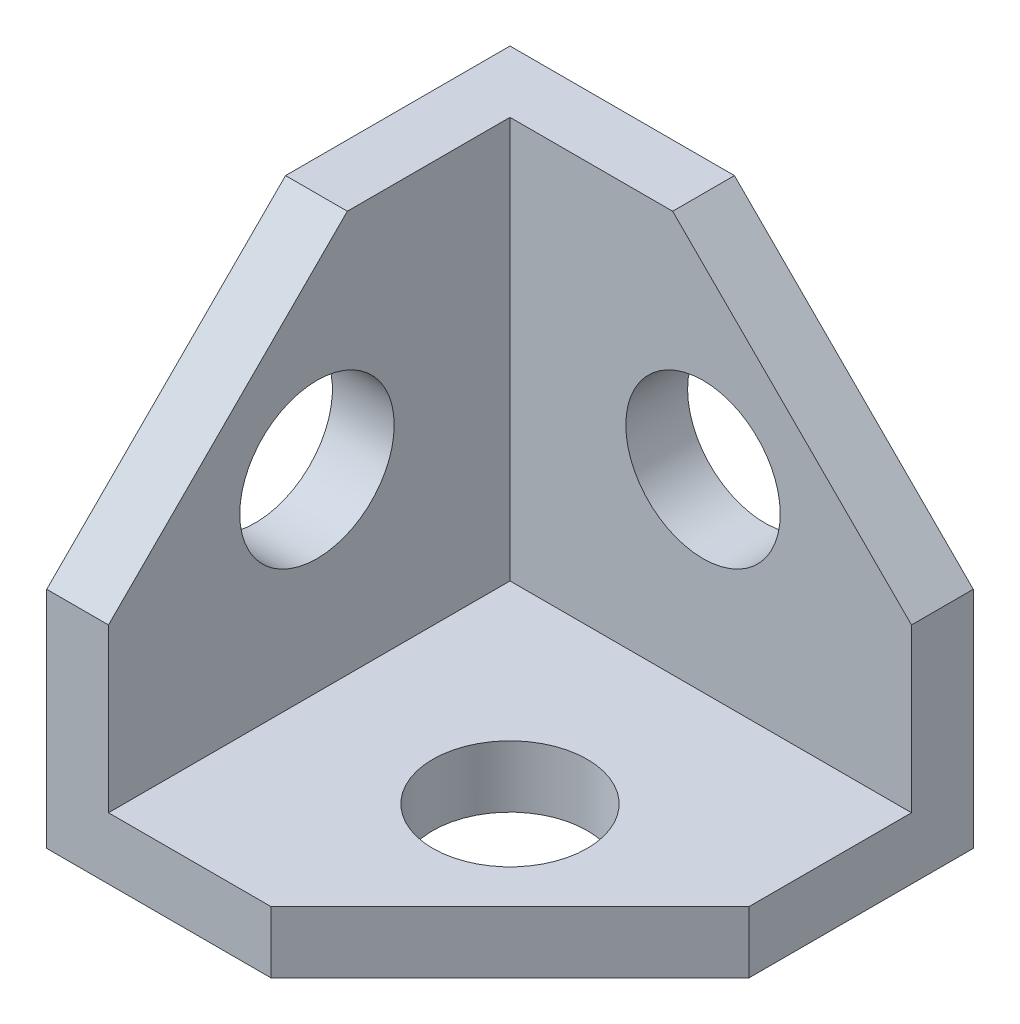
ISO-10303-21;
HEADER;
FILE_DESCRIPTION(('STEP AP214'),'2;1');
FILE_NAME('part.step','',(''),(''),'','','');
FILE_SCHEMA(('AUTOMOTIVE_DESIGN { 1 0 10303 214 1 1 1 1 }'));
ENDSEC;
DATA;
#1=APPLICATION_CONTEXT('core data for automotive mechanical design processes');
#2=APPLICATION_PROTOCOL_DEFINITION('international standard','automotive_design',2000,#1);
#3=PRODUCT_CONTEXT('',#1,'mechanical');
#4=PRODUCT('Part','Part','',(#3));
#5=PRODUCT_RELATED_PRODUCT_CATEGORY('part','',(#4));
#6=PRODUCT_DEFINITION_FORMATION('','',#4);
#7=PRODUCT_DEFINITION_CONTEXT('part definition',#1,'design');
#8=PRODUCT_DEFINITION('design','',#6,#7);
#9=PRODUCT_DEFINITION_SHAPE('','',#8);
#10=(LENGTH_UNIT() NAMED_UNIT(*) SI_UNIT(.MILLI.,.METRE.));
#11=(NAMED_UNIT(*) PLANE_ANGLE_UNIT() SI_UNIT($,.RADIAN.));
#12=(NAMED_UNIT(*) SI_UNIT($,.STERADIAN.) SOLID_ANGLE_UNIT());
#13=UNCERTAINTY_MEASURE_WITH_UNIT(LENGTH_MEASURE(1.E-05),#10,'distance_accuracy_value','');
#14=(GEOMETRIC_REPRESENTATION_CONTEXT(3) GLOBAL_UNCERTAINTY_ASSIGNED_CONTEXT((#13)) GLOBAL_UNIT_ASSIGNED_CONTEXT((#10,
#11,#12)) REPRESENTATION_CONTEXT('',''));
#15=CARTESIAN_POINT('',(0.,0.,0.));
#16=DIRECTION('',(0.,0.,1.));
#17=DIRECTION('',(1.,0.,0.));
#18=AXIS2_PLACEMENT_3D('',#15,#16,#17);
#19=CARTESIAN_POINT('',(10.2,2.4,10.2));
#20=DIRECTION('',(0.,1.,0.));
#21=DIRECTION('',(0.,0.,1.));
#22=AXIS2_PLACEMENT_3D('',#19,#20,#21);
#23=PLANE('',#22);
#24=CARTESIAN_POINT('',(9.9,2.4,9.9));
#25=DIRECTION('',(0.,1.,0.));
#26=DIRECTION('',(0.,0.,1.));
#27=AXIS2_PLACEMENT_3D('',#24,#25,#26);
#28=CIRCLE('',#27,2.99999999999999);
#29=CARTESIAN_POINT('',(9.9,2.4,12.9));
#30=VERTEX_POINT('',#29);
#31=EDGE_CURVE('E229',#30,#30,#28,.T.);
#32=ORIENTED_EDGE('',*,*,#31,.F.);
#33=EDGE_LOOP('',(#32));
#34=FACE_BOUND('',#33,.T.);
#35=DIRECTION('',(0.707106781186548,0.,-0.707106781186548));
#36=VECTOR('',#35,1.);
#37=CARTESIAN_POINT('',(13.36,2.4,13.36));
#38=LINE('',#37,#36);
#39=CARTESIAN_POINT('',(18.,2.4,8.72));
#40=VERTEX_POINT('',#39);
#41=CARTESIAN_POINT('',(8.72,2.4,18.));
#42=VERTEX_POINT('',#41);
#43=EDGE_CURVE('E294',#40,#42,#38,.F.);
#44=ORIENTED_EDGE('',*,*,#43,.F.);
#45=DIRECTION('',(0.,0.,1.));
#46=VECTOR('',#45,1.);
#47=CARTESIAN_POINT('',(18.,2.4,2.4));
#48=LINE('',#47,#46);
#49=CARTESIAN_POINT('',(18.,2.4,2.4));
#50=VERTEX_POINT('',#49);
#51=EDGE_CURVE('E57',#50,#40,#48,.T.);
#52=ORIENTED_EDGE('',*,*,#51,.F.);
#53=DIRECTION('',(1.,0.,0.));
#54=VECTOR('',#53,1.);
#55=CARTESIAN_POINT('',(18.,2.4,2.4));
#56=LINE('',#55,#54);
#57=CARTESIAN_POINT('',(2.4,2.4,2.4));
#58=VERTEX_POINT('',#57);
#59=EDGE_CURVE('E192',#58,#50,#56,.T.);
#60=ORIENTED_EDGE('',*,*,#59,.F.);
#61=DIRECTION('',(0.,0.,-1.));
#62=VECTOR('',#61,1.);
#63=CARTESIAN_POINT('',(2.4,2.4,8.72));
#64=LINE('',#63,#62);
#65=CARTESIAN_POINT('',(2.4,2.4,18.));
#66=VERTEX_POINT('',#65);
#67=EDGE_CURVE('E206',#66,#58,#64,.T.);
#68=ORIENTED_EDGE('',*,*,#67,.F.);
#69=DIRECTION('',(1.,0.,0.));
#70=VECTOR('',#69,1.);
#71=CARTESIAN_POINT('',(2.4,2.4,18.));
#72=LINE('',#71,#70);
#73=EDGE_CURVE('E209',#66,#42,#72,.T.);
#74=ORIENTED_EDGE('',*,*,#73,.T.);
#75=EDGE_LOOP('',(#44,#52,#60,#68,#74));
#76=FACE_BOUND('',#75,.T.);
#77=ADVANCED_FACE('F40',(#34,#76),#23,.T.);
#78=CARTESIAN_POINT('',(13.36,1.2,13.36));
#79=DIRECTION('',(0.707106781186548,0.,0.707106781186548));
#80=DIRECTION('',(0.707106781186548,0.,-0.707106781186548));
#81=AXIS2_PLACEMENT_3D('',#78,#79,#80);
#82=PLANE('',#81);
#83=DIRECTION('',(0.,1.,0.));
#84=VECTOR('',#83,1.);
#85=CARTESIAN_POINT('',(18.,9.,8.72));
#86=LINE('',#85,#84);
#87=CARTESIAN_POINT('',(18.,0.,8.72));
#88=VERTEX_POINT('',#87);
#89=EDGE_CURVE('E298',#88,#40,#86,.T.);
#90=ORIENTED_EDGE('',*,*,#89,.T.);
#91=ORIENTED_EDGE('',*,*,#43,.T.);
#92=DIRECTION('',(0.,1.,0.));
#93=VECTOR('',#92,1.);
#94=CARTESIAN_POINT('',(8.72,9.,18.));
#95=LINE('',#94,#93);
#96=CARTESIAN_POINT('',(8.72,0.,18.));
#97=VERTEX_POINT('',#96);
#98=EDGE_CURVE('E49',#97,#42,#95,.T.);
#99=ORIENTED_EDGE('',*,*,#98,.F.);
#100=DIRECTION('',(0.707106781186548,0.,-0.707106781186548));
#101=VECTOR('',#100,1.);
#102=CARTESIAN_POINT('',(8.72,0.,18.));
#103=LINE('',#102,#101);
#104=EDGE_CURVE('E12',#97,#88,#103,.T.);
#105=ORIENTED_EDGE('',*,*,#104,.T.);
#106=EDGE_LOOP('',(#90,#91,#99,#105));
#107=FACE_BOUND('',#106,.T.);
#108=ADVANCED_FACE('F243',(#107),#82,.T.);
#109=CARTESIAN_POINT('',(9.,0.,9.));
#110=DIRECTION('',(0.,1.,0.));
#111=DIRECTION('',(0.,0.,1.));
#112=AXIS2_PLACEMENT_3D('',#109,#110,#111);
#113=PLANE('',#112);
#114=CARTESIAN_POINT('',(9.9,0.,9.9));
#115=DIRECTION('',(0.,-1.,0.));
#116=DIRECTION('',(0.,0.,-1.));
#117=AXIS2_PLACEMENT_3D('',#114,#115,#116);
#118=CIRCLE('',#117,2.99999999999999);
#119=CARTESIAN_POINT('',(9.9,0.,6.90000000000001));
#120=VERTEX_POINT('',#119);
#121=EDGE_CURVE('E233',#120,#120,#118,.T.);
#122=ORIENTED_EDGE('',*,*,#121,.F.);
#123=EDGE_LOOP('',(#122));
#124=FACE_BOUND('',#123,.T.);
#125=ORIENTED_EDGE('',*,*,#104,.F.);
#126=DIRECTION('',(1.,0.,0.));
#127=VECTOR('',#126,1.);
#128=CARTESIAN_POINT('',(2.4,0.,18.));
#129=LINE('',#128,#127);
#130=CARTESIAN_POINT('',(0.,0.,18.));
#131=VERTEX_POINT('',#130);
#132=EDGE_CURVE('E134',#131,#97,#129,.T.);
#133=ORIENTED_EDGE('',*,*,#132,.F.);
#134=DIRECTION('',(0.,0.,1.));
#135=VECTOR('',#134,1.);
#136=CARTESIAN_POINT('',(0.,0.,18.));
#137=LINE('',#136,#135);
#138=CARTESIAN_POINT('',(0.,0.,0.));
#139=VERTEX_POINT('',#138);
#140=EDGE_CURVE('E131',#139,#131,#137,.T.);
#141=ORIENTED_EDGE('',*,*,#140,.F.);
#142=DIRECTION('',(-1.,0.,0.));
#143=VECTOR('',#142,1.);
#144=CARTESIAN_POINT('',(2.4,0.,0.));
#145=LINE('',#144,#143);
#146=CARTESIAN_POINT('',(18.,0.,0.));
#147=VERTEX_POINT('',#146);
#148=EDGE_CURVE('E120',#147,#139,#145,.T.);
#149=ORIENTED_EDGE('',*,*,#148,.F.);
#150=DIRECTION('',(0.,0.,1.));
#151=VECTOR('',#150,1.);
#152=CARTESIAN_POINT('',(18.,0.,2.4));
#153=LINE('',#152,#151);
#154=EDGE_CURVE('E201',#147,#88,#153,.T.);
#155=ORIENTED_EDGE('',*,*,#154,.T.);
#156=EDGE_LOOP('',(#125,#133,#141,#149,#155));
#157=FACE_BOUND('',#156,.T.);
#158=ADVANCED_FACE('F132',(#124,#157),#113,.F.);
#159=CARTESIAN_POINT('',(2.4,2.4,18.));
#160=DIRECTION('',(0.,0.,-1.));
#161=DIRECTION('',(-1.,0.,0.));
#162=AXIS2_PLACEMENT_3D('',#159,#160,#161);
#163=PLANE('',#162);
#164=ORIENTED_EDGE('',*,*,#98,.T.);
#165=ORIENTED_EDGE('',*,*,#73,.F.);
#166=DIRECTION('',(0.,1.,0.));
#167=VECTOR('',#166,1.);
#168=CARTESIAN_POINT('',(2.4,8.71999999999999,18.));
#169=LINE('',#168,#167);
#170=CARTESIAN_POINT('',(2.4,8.71999999999999,18.));
#171=VERTEX_POINT('',#170);
#172=EDGE_CURVE('E161',#66,#171,#169,.T.);
#173=ORIENTED_EDGE('',*,*,#172,.T.);
#174=DIRECTION('',(1.,0.,0.));
#175=VECTOR('',#174,1.);
#176=CARTESIAN_POINT('',(0.,8.71999999999999,18.));
#177=LINE('',#176,#175);
#178=CARTESIAN_POINT('',(0.,8.71999999999999,18.));
#179=VERTEX_POINT('',#178);
#180=EDGE_CURVE('E181',#179,#171,#177,.T.);
#181=ORIENTED_EDGE('',*,*,#180,.F.);
#182=DIRECTION('',(0.,1.,0.));
#183=VECTOR('',#182,1.);
#184=CARTESIAN_POINT('',(0.,8.71999999999999,18.));
#185=LINE('',#184,#183);
#186=EDGE_CURVE('E137',#131,#179,#185,.T.);
#187=ORIENTED_EDGE('',*,*,#186,.F.);
#188=ORIENTED_EDGE('',*,*,#132,.T.);
#189=EDGE_LOOP('',(#164,#165,#173,#181,#187,#188));
#190=FACE_BOUND('',#189,.T.);
#191=ADVANCED_FACE('F242',(#190),#163,.F.);
#192=CARTESIAN_POINT('',(18.,0.,2.4));
#193=DIRECTION('',(-1.,0.,0.));
#194=DIRECTION('',(0.,0.,1.));
#195=AXIS2_PLACEMENT_3D('',#192,#193,#194);
#196=PLANE('',#195);
#197=ORIENTED_EDGE('',*,*,#89,.F.);
#198=ORIENTED_EDGE('',*,*,#154,.F.);
#199=DIRECTION('',(0.,-1.,0.));
#200=VECTOR('',#199,1.);
#201=CARTESIAN_POINT('',(18.,0.,0.));
#202=LINE('',#201,#200);
#203=CARTESIAN_POINT('',(18.,8.72000000000001,0.));
#204=VERTEX_POINT('',#203);
#205=EDGE_CURVE('E126',#204,#147,#202,.T.);
#206=ORIENTED_EDGE('',*,*,#205,.F.);
#207=DIRECTION('',(0.,0.,1.));
#208=VECTOR('',#207,1.);
#209=CARTESIAN_POINT('',(18.,8.72000000000001,0.));
#210=LINE('',#209,#208);
#211=CARTESIAN_POINT('',(18.,8.72000000000001,2.4));
#212=VERTEX_POINT('',#211);
#213=EDGE_CURVE('E128',#204,#212,#210,.T.);
#214=ORIENTED_EDGE('',*,*,#213,.T.);
#215=DIRECTION('',(0.,-1.,0.));
#216=VECTOR('',#215,1.);
#217=CARTESIAN_POINT('',(18.,0.,2.4));
#218=LINE('',#217,#216);
#219=EDGE_CURVE('E168',#212,#50,#218,.T.);
#220=ORIENTED_EDGE('',*,*,#219,.T.);
#221=ORIENTED_EDGE('',*,*,#51,.T.);
#222=EDGE_LOOP('',(#197,#198,#206,#214,#220,#221));
#223=FACE_BOUND('',#222,.T.);
#224=ADVANCED_FACE('F249',(#223),#196,.F.);
#225=CARTESIAN_POINT('',(8.72,18.,0.));
#226=DIRECTION('',(0.,-1.,0.));
#227=DIRECTION('',(1.,0.,0.));
#228=AXIS2_PLACEMENT_3D('',#225,#226,#227);
#229=PLANE('',#228);
#230=DIRECTION('',(1.,0.,0.));
#231=VECTOR('',#230,1.);
#232=CARTESIAN_POINT('',(8.72,18.,2.4));
#233=LINE('',#232,#231);
#234=CARTESIAN_POINT('',(2.4,18.,2.4));
#235=VERTEX_POINT('',#234);
#236=CARTESIAN_POINT('',(8.72,18.,2.4));
#237=VERTEX_POINT('',#236);
#238=EDGE_CURVE('E180',#235,#237,#233,.T.);
#239=ORIENTED_EDGE('',*,*,#238,.T.);
#240=DIRECTION('',(0.,0.,1.));
#241=VECTOR('',#240,1.);
#242=CARTESIAN_POINT('',(8.72,18.,0.));
#243=LINE('',#242,#241);
#244=CARTESIAN_POINT('',(8.72,18.,0.));
#245=VERTEX_POINT('',#244);
#246=EDGE_CURVE('E182',#245,#237,#243,.T.);
#247=ORIENTED_EDGE('',*,*,#246,.F.);
#248=DIRECTION('',(1.,0.,0.));
#249=VECTOR('',#248,1.);
#250=CARTESIAN_POINT('',(8.72,18.,0.));
#251=LINE('',#250,#249);
#252=CARTESIAN_POINT('',(0.,18.,0.));
#253=VERTEX_POINT('',#252);
#254=EDGE_CURVE('E165',#253,#245,#251,.T.);
#255=ORIENTED_EDGE('',*,*,#254,.F.);
#256=DIRECTION('',(0.,0.,-1.));
#257=VECTOR('',#256,1.);
#258=CARTESIAN_POINT('',(0.,18.,0.));
#259=LINE('',#258,#257);
#260=CARTESIAN_POINT('',(0.,18.,8.72000000000001));
#261=VERTEX_POINT('',#260);
#262=EDGE_CURVE('E142',#261,#253,#259,.T.);
#263=ORIENTED_EDGE('',*,*,#262,.F.);
#264=DIRECTION('',(1.,0.,0.));
#265=VECTOR('',#264,1.);
#266=CARTESIAN_POINT('',(0.,18.,8.72000000000001));
#267=LINE('',#266,#265);
#268=CARTESIAN_POINT('',(2.4,18.,8.72000000000001));
#269=VERTEX_POINT('',#268);
#270=EDGE_CURVE('E156',#261,#269,#267,.T.);
#271=ORIENTED_EDGE('',*,*,#270,.T.);
#272=DIRECTION('',(0.,0.,-1.));
#273=VECTOR('',#272,1.);
#274=CARTESIAN_POINT('',(2.4,18.,0.));
#275=LINE('',#274,#273);
#276=EDGE_CURVE('E143',#269,#235,#275,.T.);
#277=ORIENTED_EDGE('',*,*,#276,.T.);
#278=EDGE_LOOP('',(#239,#247,#255,#263,#271,#277));
#279=FACE_BOUND('',#278,.T.);
#280=ADVANCED_FACE('F255',(#279),#229,.F.);
#281=CARTESIAN_POINT('',(18.,8.72000000000001,0.));
#282=DIRECTION('',(-0.707106781186547,-0.707106781186548,0.));
#283=DIRECTION('',(0.707106781186548,-0.707106781186547,0.));
#284=AXIS2_PLACEMENT_3D('',#281,#282,#283);
#285=PLANE('',#284);
#286=DIRECTION('',(0.707106781186548,-0.707106781186547,0.));
#287=VECTOR('',#286,1.);
#288=CARTESIAN_POINT('',(18.,8.72000000000001,2.4));
#289=LINE('',#288,#287);
#290=EDGE_CURVE('E173',#237,#212,#289,.T.);
#291=ORIENTED_EDGE('',*,*,#290,.T.);
#292=ORIENTED_EDGE('',*,*,#213,.F.);
#293=DIRECTION('',(0.707106781186548,-0.707106781186547,0.));
#294=VECTOR('',#293,1.);
#295=CARTESIAN_POINT('',(18.,8.72000000000001,0.));
#296=LINE('',#295,#294);
#297=EDGE_CURVE('E167',#245,#204,#296,.T.);
#298=ORIENTED_EDGE('',*,*,#297,.F.);
#299=ORIENTED_EDGE('',*,*,#246,.T.);
#300=EDGE_LOOP('',(#291,#292,#298,#299));
#301=FACE_BOUND('',#300,.T.);
#302=ADVANCED_FACE('F258',(#301),#285,.F.);
#303=CARTESIAN_POINT('',(0.,0.,0.));
#304=DIRECTION('',(0.,0.,1.));
#305=DIRECTION('',(1.,0.,0.));
#306=AXIS2_PLACEMENT_3D('',#303,#304,#305);
#307=PLANE('',#306);
#308=CARTESIAN_POINT('',(9.9,9.9,0.));
#309=DIRECTION('',(0.,0.,-1.));
#310=DIRECTION('',(-1.,0.,0.));
#311=AXIS2_PLACEMENT_3D('',#308,#309,#310);
#312=CIRCLE('',#311,2.99999999999999);
#313=CARTESIAN_POINT('',(6.90000000000001,9.9,0.));
#314=VERTEX_POINT('',#313);
#315=EDGE_CURVE('E225',#314,#314,#312,.T.);
#316=ORIENTED_EDGE('',*,*,#315,.F.);
#317=EDGE_LOOP('',(#316));
#318=FACE_BOUND('',#317,.T.);
#319=ORIENTED_EDGE('',*,*,#148,.T.);
#320=DIRECTION('',(0.,-1.,0.));
#321=VECTOR('',#320,1.);
#322=CARTESIAN_POINT('',(0.,0.,0.));
#323=LINE('',#322,#321);
#324=EDGE_CURVE('E124',#253,#139,#323,.T.);
#325=ORIENTED_EDGE('',*,*,#324,.F.);
#326=ORIENTED_EDGE('',*,*,#254,.T.);
#327=ORIENTED_EDGE('',*,*,#297,.T.);
#328=ORIENTED_EDGE('',*,*,#205,.T.);
#329=EDGE_LOOP('',(#319,#325,#326,#327,#328));
#330=FACE_BOUND('',#329,.T.);
#331=ADVANCED_FACE('F122',(#318,#330),#307,.F.);
#332=CARTESIAN_POINT('',(0.,0.,2.4));
#333=DIRECTION('',(0.,0.,1.));
#334=DIRECTION('',(1.,0.,0.));
#335=AXIS2_PLACEMENT_3D('',#332,#333,#334);
#336=PLANE('',#335);
#337=CARTESIAN_POINT('',(9.9,9.9,2.4));
#338=DIRECTION('',(0.,0.,1.));
#339=DIRECTION('',(1.,0.,0.));
#340=AXIS2_PLACEMENT_3D('',#337,#338,#339);
#341=CIRCLE('',#340,2.99999999999999);
#342=CARTESIAN_POINT('',(12.9,9.9,2.4));
#343=VERTEX_POINT('',#342);
#344=EDGE_CURVE('E43',#343,#343,#341,.T.);
#345=ORIENTED_EDGE('',*,*,#344,.F.);
#346=EDGE_LOOP('',(#345));
#347=FACE_BOUND('',#346,.T.);
#348=DIRECTION('',(0.,1.,0.));
#349=VECTOR('',#348,1.);
#350=CARTESIAN_POINT('',(2.4,18.,2.4));
#351=LINE('',#350,#349);
#352=EDGE_CURVE('E176',#58,#235,#351,.T.);
#353=ORIENTED_EDGE('',*,*,#352,.F.);
#354=ORIENTED_EDGE('',*,*,#59,.T.);
#355=ORIENTED_EDGE('',*,*,#219,.F.);
#356=ORIENTED_EDGE('',*,*,#290,.F.);
#357=ORIENTED_EDGE('',*,*,#238,.F.);
#358=EDGE_LOOP('',(#353,#354,#355,#356,#357));
#359=FACE_BOUND('',#358,.T.);
#360=ADVANCED_FACE('F262',(#347,#359),#336,.T.);
#361=CARTESIAN_POINT('',(0.,18.,8.72000000000001));
#362=DIRECTION('',(0.,-0.707106781186547,-0.707106781186548));
#363=DIRECTION('',(0.,0.707106781186548,-0.707106781186547));
#364=AXIS2_PLACEMENT_3D('',#361,#362,#363);
#365=PLANE('',#364);
#366=DIRECTION('',(0.,0.707106781186548,-0.707106781186547));
#367=VECTOR('',#366,1.);
#368=CARTESIAN_POINT('',(2.4,18.,8.72000000000001));
#369=LINE('',#368,#367);
#370=EDGE_CURVE('E146',#171,#269,#369,.T.);
#371=ORIENTED_EDGE('',*,*,#370,.T.);
#372=ORIENTED_EDGE('',*,*,#270,.F.);
#373=DIRECTION('',(0.,0.707106781186548,-0.707106781186547));
#374=VECTOR('',#373,1.);
#375=CARTESIAN_POINT('',(0.,18.,8.72000000000001));
#376=LINE('',#375,#374);
#377=EDGE_CURVE('E153',#179,#261,#376,.T.);
#378=ORIENTED_EDGE('',*,*,#377,.F.);
#379=ORIENTED_EDGE('',*,*,#180,.T.);
#380=EDGE_LOOP('',(#371,#372,#378,#379));
#381=FACE_BOUND('',#380,.T.);
#382=ADVANCED_FACE('F265',(#381),#365,.F.);
#383=CARTESIAN_POINT('',(0.,0.,0.));
#384=DIRECTION('',(1.,0.,0.));
#385=DIRECTION('',(0.,0.,-1.));
#386=AXIS2_PLACEMENT_3D('',#383,#384,#385);
#387=PLANE('',#386);
#388=CARTESIAN_POINT('',(0.,9.9,9.9));
#389=DIRECTION('',(-1.,0.,0.));
#390=DIRECTION('',(0.,0.,1.));
#391=AXIS2_PLACEMENT_3D('',#388,#389,#390);
#392=CIRCLE('',#391,2.99999999999999);
#393=CARTESIAN_POINT('',(0.,9.9,12.9));
#394=VERTEX_POINT('',#393);
#395=EDGE_CURVE('E149',#394,#394,#392,.T.);
#396=ORIENTED_EDGE('',*,*,#395,.F.);
#397=EDGE_LOOP('',(#396));
#398=FACE_BOUND('',#397,.T.);
#399=ORIENTED_EDGE('',*,*,#324,.T.);
#400=ORIENTED_EDGE('',*,*,#140,.T.);
#401=ORIENTED_EDGE('',*,*,#186,.T.);
#402=ORIENTED_EDGE('',*,*,#377,.T.);
#403=ORIENTED_EDGE('',*,*,#262,.T.);
#404=EDGE_LOOP('',(#399,#400,#401,#402,#403));
#405=FACE_BOUND('',#404,.T.);
#406=ADVANCED_FACE('F140',(#398,#405),#387,.F.);
#407=CARTESIAN_POINT('',(2.4,0.,0.));
#408=DIRECTION('',(1.,0.,0.));
#409=DIRECTION('',(0.,0.,-1.));
#410=AXIS2_PLACEMENT_3D('',#407,#408,#409);
#411=PLANE('',#410);
#412=CARTESIAN_POINT('',(2.4,9.9,9.9));
#413=DIRECTION('',(1.,0.,0.));
#414=DIRECTION('',(0.,0.,-1.));
#415=AXIS2_PLACEMENT_3D('',#412,#413,#414);
#416=CIRCLE('',#415,2.99999999999999);
#417=CARTESIAN_POINT('',(2.4,9.9,6.90000000000001));
#418=VERTEX_POINT('',#417);
#419=EDGE_CURVE('E163',#418,#418,#416,.T.);
#420=ORIENTED_EDGE('',*,*,#419,.F.);
#421=EDGE_LOOP('',(#420));
#422=FACE_BOUND('',#421,.T.);
#423=ORIENTED_EDGE('',*,*,#172,.F.);
#424=ORIENTED_EDGE('',*,*,#67,.T.);
#425=ORIENTED_EDGE('',*,*,#352,.T.);
#426=ORIENTED_EDGE('',*,*,#276,.F.);
#427=ORIENTED_EDGE('',*,*,#370,.F.);
#428=EDGE_LOOP('',(#423,#424,#425,#426,#427));
#429=FACE_BOUND('',#428,.T.);
#430=ADVANCED_FACE('F273',(#422,#429),#411,.T.);
#431=CARTESIAN_POINT('',(0.,9.9,9.9));
#432=DIRECTION('',(-1.,0.,0.));
#433=DIRECTION('',(0.,0.,1.));
#434=AXIS2_PLACEMENT_3D('',#431,#432,#433);
#435=CYLINDRICAL_SURFACE('',#434,2.99999999999999);
#436=ORIENTED_EDGE('',*,*,#419,.T.);
#437=EDGE_LOOP('',(#436));
#438=FACE_BOUND('',#437,.T.);
#439=ORIENTED_EDGE('',*,*,#395,.T.);
#440=EDGE_LOOP('',(#439));
#441=FACE_BOUND('',#440,.T.);
#442=ADVANCED_FACE('F276',(#438,#441),#435,.F.);
#443=CARTESIAN_POINT('',(9.9,9.9,0.));
#444=DIRECTION('',(0.,0.,-1.));
#445=DIRECTION('',(-1.,0.,0.));
#446=AXIS2_PLACEMENT_3D('',#443,#444,#445);
#447=CYLINDRICAL_SURFACE('',#446,2.99999999999999);
#448=ORIENTED_EDGE('',*,*,#344,.T.);
#449=EDGE_LOOP('',(#448));
#450=FACE_BOUND('',#449,.T.);
#451=ORIENTED_EDGE('',*,*,#315,.T.);
#452=EDGE_LOOP('',(#451));
#453=FACE_BOUND('',#452,.T.);
#454=ADVANCED_FACE('F283',(#450,#453),#447,.F.);
#455=CARTESIAN_POINT('',(9.9,0.,9.9));
#456=DIRECTION('',(0.,-1.,0.));
#457=DIRECTION('',(0.,0.,-1.));
#458=AXIS2_PLACEMENT_3D('',#455,#456,#457);
#459=CYLINDRICAL_SURFACE('',#458,2.99999999999999);
#460=ORIENTED_EDGE('',*,*,#31,.T.);
#461=EDGE_LOOP('',(#460));
#462=FACE_BOUND('',#461,.T.);
#463=ORIENTED_EDGE('',*,*,#121,.T.);
#464=EDGE_LOOP('',(#463));
#465=FACE_BOUND('',#464,.T.);
#466=ADVANCED_FACE('F239',(#462,#465),#459,.F.);
#467=CLOSED_SHELL('',(#77,#108,#158,#191,#224,#280,#302,#331,#360,#382,#406,#430,#442,#454,#466));
#468=MANIFOLD_SOLID_BREP('B2',#467);
#469=ADVANCED_BREP_SHAPE_REPRESENTATION('',(#18,#468),#14);
#470=SHAPE_DEFINITION_REPRESENTATION(#9,#469);
ENDSEC;
END-ISO-10303-21;
